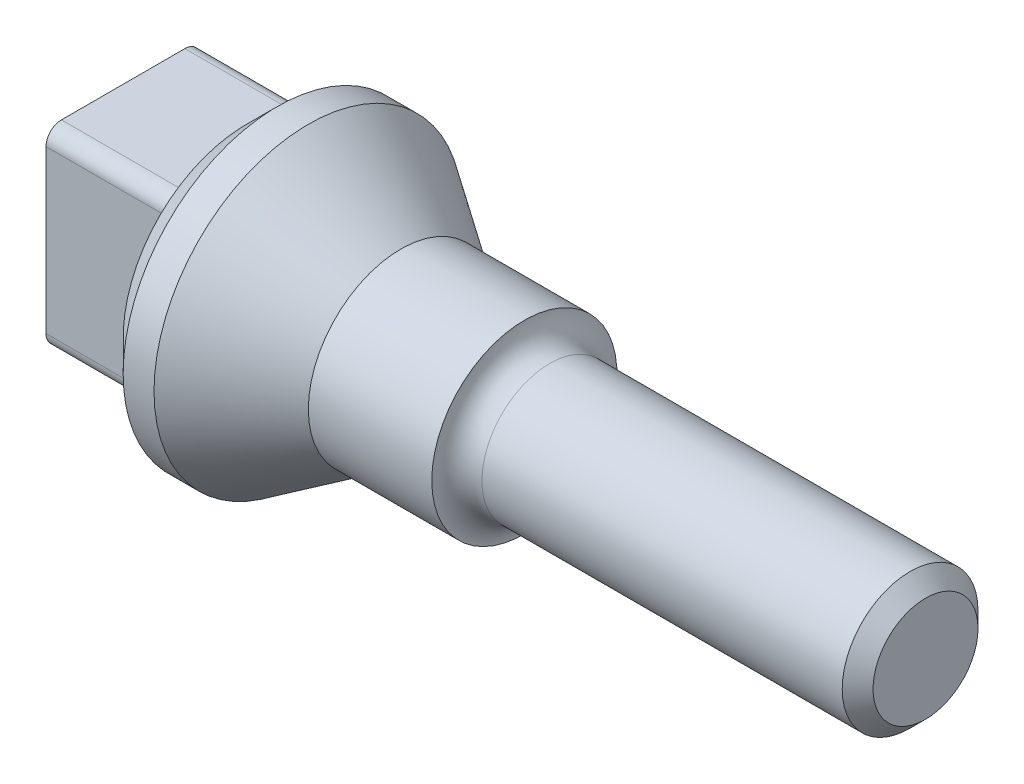
ISO-10303-21;
HEADER;
FILE_DESCRIPTION(('STEP AP214'),'2;1');
FILE_NAME('part.step','',(''),(''),'','','');
FILE_SCHEMA(('AUTOMOTIVE_DESIGN { 1 0 10303 214 1 1 1 1 }'));
ENDSEC;
DATA;
#1=APPLICATION_CONTEXT('core data for automotive mechanical design processes');
#2=APPLICATION_PROTOCOL_DEFINITION('international standard','automotive_design',2000,#1);
#3=PRODUCT_CONTEXT('',#1,'mechanical');
#4=PRODUCT('Part','Part','',(#3));
#5=PRODUCT_RELATED_PRODUCT_CATEGORY('part','',(#4));
#6=PRODUCT_DEFINITION_FORMATION('','',#4);
#7=PRODUCT_DEFINITION_CONTEXT('part definition',#1,'design');
#8=PRODUCT_DEFINITION('design','',#6,#7);
#9=PRODUCT_DEFINITION_SHAPE('','',#8);
#10=(LENGTH_UNIT() NAMED_UNIT(*) SI_UNIT(.MILLI.,.METRE.));
#11=(NAMED_UNIT(*) PLANE_ANGLE_UNIT() SI_UNIT($,.RADIAN.));
#12=(NAMED_UNIT(*) SI_UNIT($,.STERADIAN.) SOLID_ANGLE_UNIT());
#13=UNCERTAINTY_MEASURE_WITH_UNIT(LENGTH_MEASURE(1.E-05),#10,'distance_accuracy_value','');
#14=(GEOMETRIC_REPRESENTATION_CONTEXT(3) GLOBAL_UNCERTAINTY_ASSIGNED_CONTEXT((#13)) GLOBAL_UNIT_ASSIGNED_CONTEXT((#10,
#11,#12)) REPRESENTATION_CONTEXT('',''));
#15=CARTESIAN_POINT('',(0.,0.,0.));
#16=DIRECTION('',(0.,0.,1.));
#17=DIRECTION('',(1.,0.,0.));
#18=AXIS2_PLACEMENT_3D('',#15,#16,#17);
#19=CARTESIAN_POINT('',(0.,0.,0.));
#20=DIRECTION('',(-1.,0.,0.));
#21=DIRECTION('',(0.,0.,1.));
#22=AXIS2_PLACEMENT_3D('',#19,#20,#21);
#23=PLANE('',#22);
#24=CARTESIAN_POINT('',(0.,0.,0.));
#25=DIRECTION('',(-1.,0.,0.));
#26=DIRECTION('',(0.,0.,1.));
#27=AXIS2_PLACEMENT_3D('',#24,#25,#26);
#28=CIRCLE('',#27,40.);
#29=CARTESIAN_POINT('',(0.,-31.224989991992,-25.));
#30=VERTEX_POINT('',#29);
#31=CARTESIAN_POINT('',(0.,-31.224989991992,25.));
#32=VERTEX_POINT('',#31);
#33=EDGE_CURVE('E135',#30,#32,#28,.T.);
#34=ORIENTED_EDGE('',*,*,#33,.T.);
#35=CARTESIAN_POINT('',(0.,31.224989991992,25.));
#36=VERTEX_POINT('',#35);
#37=EDGE_CURVE('E129',#32,#36,#28,.T.);
#38=ORIENTED_EDGE('',*,*,#37,.T.);
#39=CARTESIAN_POINT('',(0.,31.224989991992,-25.));
#40=VERTEX_POINT('',#39);
#41=EDGE_CURVE('E124',#36,#40,#28,.T.);
#42=ORIENTED_EDGE('',*,*,#41,.T.);
#43=EDGE_CURVE('E128',#40,#30,#28,.T.);
#44=ORIENTED_EDGE('',*,*,#43,.T.);
#45=EDGE_LOOP('',(#34,#38,#42,#44));
#46=FACE_BOUND('',#45,.T.);
#47=DIRECTION('',(0.,0.,1.));
#48=VECTOR('',#47,1.);
#49=CARTESIAN_POINT('',(0.,-31.224989991992,-25.));
#50=LINE('',#49,#48);
#51=CARTESIAN_POINT('',(0.,-31.224989991992,-20.));
#52=VERTEX_POINT('',#51);
#53=CARTESIAN_POINT('',(0.,-31.224989991992,20.));
#54=VERTEX_POINT('',#53);
#55=EDGE_CURVE('E60',#52,#54,#50,.T.);
#56=ORIENTED_EDGE('',*,*,#55,.F.);
#57=CARTESIAN_POINT('',(0.,-26.224989991992,-20.));
#58=DIRECTION('',(-1.,0.,0.));
#59=DIRECTION('',(0.,0.,1.));
#60=AXIS2_PLACEMENT_3D('',#57,#58,#59);
#61=CIRCLE('',#60,5.);
#62=CARTESIAN_POINT('',(0.,-26.224989991992,-25.));
#63=VERTEX_POINT('',#62);
#64=EDGE_CURVE('E188',#52,#63,#61,.F.);
#65=ORIENTED_EDGE('',*,*,#64,.T.);
#66=DIRECTION('',(0.,-1.,0.));
#67=VECTOR('',#66,1.);
#68=CARTESIAN_POINT('',(0.,-31.224989991992,-25.));
#69=LINE('',#68,#67);
#70=CARTESIAN_POINT('',(0.,26.224989991992,-25.));
#71=VERTEX_POINT('',#70);
#72=EDGE_CURVE('E68',#71,#63,#69,.T.);
#73=ORIENTED_EDGE('',*,*,#72,.F.);
#74=CARTESIAN_POINT('',(0.,26.224989991992,-20.));
#75=DIRECTION('',(-1.,0.,0.));
#76=DIRECTION('',(0.,0.,1.));
#77=AXIS2_PLACEMENT_3D('',#74,#75,#76);
#78=CIRCLE('',#77,5.);
#79=CARTESIAN_POINT('',(0.,31.224989991992,-20.));
#80=VERTEX_POINT('',#79);
#81=EDGE_CURVE('E184',#71,#80,#78,.F.);
#82=ORIENTED_EDGE('',*,*,#81,.T.);
#83=DIRECTION('',(0.,0.,-1.));
#84=VECTOR('',#83,1.);
#85=CARTESIAN_POINT('',(0.,31.224989991992,-25.));
#86=LINE('',#85,#84);
#87=CARTESIAN_POINT('',(0.,31.224989991992,20.));
#88=VERTEX_POINT('',#87);
#89=EDGE_CURVE('E261',#88,#80,#86,.T.);
#90=ORIENTED_EDGE('',*,*,#89,.F.);
#91=CARTESIAN_POINT('',(0.,26.224989991992,20.));
#92=DIRECTION('',(-1.,0.,0.));
#93=DIRECTION('',(0.,0.,1.));
#94=AXIS2_PLACEMENT_3D('',#91,#92,#93);
#95=CIRCLE('',#94,5.);
#96=CARTESIAN_POINT('',(0.,26.224989991992,25.));
#97=VERTEX_POINT('',#96);
#98=EDGE_CURVE('E152',#88,#97,#95,.F.);
#99=ORIENTED_EDGE('',*,*,#98,.T.);
#100=DIRECTION('',(0.,1.,0.));
#101=VECTOR('',#100,1.);
#102=CARTESIAN_POINT('',(0.,-31.224989991992,25.));
#103=LINE('',#102,#101);
#104=CARTESIAN_POINT('',(0.,-26.224989991992,25.));
#105=VERTEX_POINT('',#104);
#106=EDGE_CURVE('E258',#105,#97,#103,.T.);
#107=ORIENTED_EDGE('',*,*,#106,.F.);
#108=CARTESIAN_POINT('',(0.,-26.224989991992,20.));
#109=DIRECTION('',(-1.,0.,0.));
#110=DIRECTION('',(0.,0.,1.));
#111=AXIS2_PLACEMENT_3D('',#108,#109,#110);
#112=CIRCLE('',#111,5.);
#113=EDGE_CURVE('E191',#105,#54,#112,.F.);
#114=ORIENTED_EDGE('',*,*,#113,.T.);
#115=EDGE_LOOP('',(#56,#65,#73,#82,#90,#99,#107,#114));
#116=FACE_BOUND('',#115,.T.);
#117=ADVANCED_FACE('F43',(#46,#116),#23,.T.);
#118=CARTESIAN_POINT('',(0.,0.,0.));
#119=DIRECTION('',(1.,0.,0.));
#120=DIRECTION('',(0.,0.,-1.));
#121=AXIS2_PLACEMENT_3D('',#118,#119,#120);
#122=CONICAL_SURFACE('',#121,40.,0.785398163397448);
#123=CARTESIAN_POINT('',(10.,0.,0.));
#124=DIRECTION('',(-1.,0.,0.));
#125=DIRECTION('',(0.,0.,1.));
#126=AXIS2_PLACEMENT_3D('',#123,#124,#125);
#127=CIRCLE('',#126,50.);
#128=CARTESIAN_POINT('',(10.,0.,50.));
#129=VERTEX_POINT('',#128);
#130=EDGE_CURVE('E140',#129,#129,#127,.T.);
#131=ORIENTED_EDGE('',*,*,#130,.T.);
#132=EDGE_LOOP('',(#131));
#133=FACE_BOUND('',#132,.T.);
#134=ORIENTED_EDGE('',*,*,#41,.F.);
#135=ORIENTED_EDGE('',*,*,#37,.F.);
#136=ORIENTED_EDGE('',*,*,#33,.F.);
#137=ORIENTED_EDGE('',*,*,#43,.F.);
#138=EDGE_LOOP('',(#134,#135,#136,#137));
#139=FACE_BOUND('',#138,.T.);
#140=ADVANCED_FACE('F134',(#133,#139),#122,.T.);
#141=CARTESIAN_POINT('',(0.,0.,0.));
#142=DIRECTION('',(-1.,0.,0.));
#143=DIRECTION('',(0.,0.,1.));
#144=AXIS2_PLACEMENT_3D('',#141,#142,#143);
#145=CYLINDRICAL_SURFACE('',#144,50.);
#146=CARTESIAN_POINT('',(20.,0.,0.));
#147=DIRECTION('',(-1.,0.,0.));
#148=DIRECTION('',(0.,0.,1.));
#149=AXIS2_PLACEMENT_3D('',#146,#147,#148);
#150=CIRCLE('',#149,50.);
#151=CARTESIAN_POINT('',(20.,0.,50.));
#152=VERTEX_POINT('',#151);
#153=EDGE_CURVE('E275',#152,#152,#150,.T.);
#154=ORIENTED_EDGE('',*,*,#153,.T.);
#155=EDGE_LOOP('',(#154));
#156=FACE_BOUND('',#155,.T.);
#157=ORIENTED_EDGE('',*,*,#130,.F.);
#158=EDGE_LOOP('',(#157));
#159=FACE_BOUND('',#158,.T.);
#160=ADVANCED_FACE('F214',(#156,#159),#145,.T.);
#161=CARTESIAN_POINT('',(20.,0.,0.));
#162=DIRECTION('',(-1.,0.,0.));
#163=DIRECTION('',(0.,0.,1.));
#164=AXIS2_PLACEMENT_3D('',#161,#162,#163);
#165=CONICAL_SURFACE('',#164,50.,0.588002603547568);
#166=CARTESIAN_POINT('',(50.,0.,0.));
#167=DIRECTION('',(-1.,0.,0.));
#168=DIRECTION('',(0.,0.,1.));
#169=AXIS2_PLACEMENT_3D('',#166,#167,#168);
#170=CIRCLE('',#169,30.);
#171=CARTESIAN_POINT('',(50.,0.,30.));
#172=VERTEX_POINT('',#171);
#173=EDGE_CURVE('E272',#172,#172,#170,.T.);
#174=ORIENTED_EDGE('',*,*,#173,.T.);
#175=EDGE_LOOP('',(#174));
#176=FACE_BOUND('',#175,.T.);
#177=ORIENTED_EDGE('',*,*,#153,.F.);
#178=EDGE_LOOP('',(#177));
#179=FACE_BOUND('',#178,.T.);
#180=ADVANCED_FACE('F286',(#176,#179),#165,.T.);
#181=CARTESIAN_POINT('',(0.,0.,0.));
#182=DIRECTION('',(-1.,0.,0.));
#183=DIRECTION('',(0.,0.,1.));
#184=AXIS2_PLACEMENT_3D('',#181,#182,#183);
#185=CYLINDRICAL_SURFACE('',#184,30.);
#186=CARTESIAN_POINT('',(90.,0.,0.));
#187=DIRECTION('',(-1.,0.,0.));
#188=DIRECTION('',(0.,0.,1.));
#189=AXIS2_PLACEMENT_3D('',#186,#187,#188);
#190=CIRCLE('',#189,30.);
#191=CARTESIAN_POINT('',(90.,0.,30.));
#192=VERTEX_POINT('',#191);
#193=EDGE_CURVE('E252',#192,#192,#190,.T.);
#194=ORIENTED_EDGE('',*,*,#193,.T.);
#195=EDGE_LOOP('',(#194));
#196=FACE_BOUND('',#195,.T.);
#197=ORIENTED_EDGE('',*,*,#173,.F.);
#198=EDGE_LOOP('',(#197));
#199=FACE_BOUND('',#198,.T.);
#200=ADVANCED_FACE('F290',(#196,#199),#185,.T.);
#201=CARTESIAN_POINT('',(98.2329651863445,0.,0.));
#202=DIRECTION('',(-1.,0.,0.));
#203=DIRECTION('',(0.,0.,1.));
#204=AXIS2_PLACEMENT_3D('',#201,#202,#203);
#205=TOROIDAL_SURFACE('',#204,30.2363572349726,8.23635723497257);
#206=ORIENTED_EDGE('',*,*,#193,.F.);
#207=EDGE_LOOP('',(#206));
#208=FACE_BOUND('',#207,.T.);
#209=CARTESIAN_POINT('',(98.2329651863445,0.,0.));
#210=DIRECTION('',(-1.,0.,0.));
#211=DIRECTION('',(0.,0.,1.));
#212=AXIS2_PLACEMENT_3D('',#209,#210,#211);
#213=CIRCLE('',#212,22.);
#214=CARTESIAN_POINT('',(98.2329651863445,0.,22.));
#215=VERTEX_POINT('',#214);
#216=EDGE_CURVE('E247',#215,#215,#213,.T.);
#217=ORIENTED_EDGE('',*,*,#216,.T.);
#218=EDGE_LOOP('',(#217));
#219=FACE_BOUND('',#218,.T.);
#220=ADVANCED_FACE('F296',(#208,#219),#205,.F.);
#221=CARTESIAN_POINT('',(0.,0.,0.));
#222=DIRECTION('',(-1.,0.,0.));
#223=DIRECTION('',(0.,0.,1.));
#224=AXIS2_PLACEMENT_3D('',#221,#222,#223);
#225=CYLINDRICAL_SURFACE('',#224,22.);
#226=CARTESIAN_POINT('',(215.,0.,0.));
#227=DIRECTION('',(1.,0.,0.));
#228=DIRECTION('',(0.,0.,-1.));
#229=AXIS2_PLACEMENT_3D('',#226,#227,#228);
#230=CIRCLE('',#229,22.);
#231=CARTESIAN_POINT('',(215.,0.,-22.));
#232=VERTEX_POINT('',#231);
#233=EDGE_CURVE('E53',#232,#232,#230,.F.);
#234=ORIENTED_EDGE('',*,*,#233,.T.);
#235=EDGE_LOOP('',(#234));
#236=FACE_BOUND('',#235,.T.);
#237=ORIENTED_EDGE('',*,*,#216,.F.);
#238=EDGE_LOOP('',(#237));
#239=FACE_BOUND('',#238,.T.);
#240=ADVANCED_FACE('F197',(#236,#239),#225,.T.);
#241=CARTESIAN_POINT('',(220.,0.,0.));
#242=DIRECTION('',(1.,0.,0.));
#243=DIRECTION('',(0.,0.,-1.));
#244=AXIS2_PLACEMENT_3D('',#241,#242,#243);
#245=PLANE('',#244);
#246=CARTESIAN_POINT('',(220.,0.,0.));
#247=DIRECTION('',(1.,0.,0.));
#248=DIRECTION('',(0.,0.,-1.));
#249=AXIS2_PLACEMENT_3D('',#246,#247,#248);
#250=CIRCLE('',#249,17.);
#251=CARTESIAN_POINT('',(220.,0.,-17.));
#252=VERTEX_POINT('',#251);
#253=EDGE_CURVE('E11',#252,#252,#250,.T.);
#254=ORIENTED_EDGE('',*,*,#253,.T.);
#255=EDGE_LOOP('',(#254));
#256=FACE_BOUND('',#255,.T.);
#257=ADVANCED_FACE('F303',(#256),#245,.T.);
#258=CARTESIAN_POINT('',(-40.,-31.224989991992,25.));
#259=DIRECTION('',(0.,0.,-1.));
#260=DIRECTION('',(-1.,0.,0.));
#261=AXIS2_PLACEMENT_3D('',#258,#259,#260);
#262=PLANE('',#261);
#263=DIRECTION('',(0.,1.,0.));
#264=VECTOR('',#263,1.);
#265=CARTESIAN_POINT('',(-40.,-31.224989991992,25.));
#266=LINE('',#265,#264);
#267=CARTESIAN_POINT('',(-40.,-26.224989991992,25.));
#268=VERTEX_POINT('',#267);
#269=CARTESIAN_POINT('',(-40.,26.224989991992,25.));
#270=VERTEX_POINT('',#269);
#271=EDGE_CURVE('E267',#268,#270,#266,.T.);
#272=ORIENTED_EDGE('',*,*,#271,.F.);
#273=DIRECTION('',(1.,0.,0.));
#274=VECTOR('',#273,1.);
#275=CARTESIAN_POINT('',(-40.,-26.224989991992,25.));
#276=LINE('',#275,#274);
#277=EDGE_CURVE('E180',#268,#105,#276,.T.);
#278=ORIENTED_EDGE('',*,*,#277,.T.);
#279=ORIENTED_EDGE('',*,*,#106,.T.);
#280=DIRECTION('',(1.,0.,0.));
#281=VECTOR('',#280,1.);
#282=CARTESIAN_POINT('',(-40.,26.224989991992,25.));
#283=LINE('',#282,#281);
#284=EDGE_CURVE('E145',#97,#270,#283,.F.);
#285=ORIENTED_EDGE('',*,*,#284,.T.);
#286=EDGE_LOOP('',(#272,#278,#279,#285));
#287=FACE_BOUND('',#286,.T.);
#288=ADVANCED_FACE('F306',(#287),#262,.F.);
#289=CARTESIAN_POINT('',(-40.,31.224989991992,-25.));
#290=DIRECTION('',(0.,-1.,0.));
#291=DIRECTION('',(0.,0.,-1.));
#292=AXIS2_PLACEMENT_3D('',#289,#290,#291);
#293=PLANE('',#292);
#294=ORIENTED_EDGE('',*,*,#89,.T.);
#295=DIRECTION('',(1.,0.,0.));
#296=VECTOR('',#295,1.);
#297=CARTESIAN_POINT('',(-40.,31.224989991992,-20.));
#298=LINE('',#297,#296);
#299=CARTESIAN_POINT('',(-40.,31.224989991992,-20.));
#300=VERTEX_POINT('',#299);
#301=EDGE_CURVE('E162',#80,#300,#298,.F.);
#302=ORIENTED_EDGE('',*,*,#301,.T.);
#303=DIRECTION('',(0.,0.,-1.));
#304=VECTOR('',#303,1.);
#305=CARTESIAN_POINT('',(-40.,31.224989991992,-25.));
#306=LINE('',#305,#304);
#307=CARTESIAN_POINT('',(-40.,31.224989991992,20.));
#308=VERTEX_POINT('',#307);
#309=EDGE_CURVE('E254',#308,#300,#306,.T.);
#310=ORIENTED_EDGE('',*,*,#309,.F.);
#311=DIRECTION('',(1.,0.,0.));
#312=VECTOR('',#311,1.);
#313=CARTESIAN_POINT('',(-40.,31.224989991992,20.));
#314=LINE('',#313,#312);
#315=EDGE_CURVE('E132',#308,#88,#314,.T.);
#316=ORIENTED_EDGE('',*,*,#315,.T.);
#317=EDGE_LOOP('',(#294,#302,#310,#316));
#318=FACE_BOUND('',#317,.T.);
#319=ADVANCED_FACE('F310',(#318),#293,.F.);
#320=CARTESIAN_POINT('',(-40.,-31.224989991992,-25.));
#321=DIRECTION('',(0.,0.,1.));
#322=DIRECTION('',(1.,0.,0.));
#323=AXIS2_PLACEMENT_3D('',#320,#321,#322);
#324=PLANE('',#323);
#325=DIRECTION('',(0.,-1.,0.));
#326=VECTOR('',#325,1.);
#327=CARTESIAN_POINT('',(-40.,-31.224989991992,-25.));
#328=LINE('',#327,#326);
#329=CARTESIAN_POINT('',(-40.,26.224989991992,-25.));
#330=VERTEX_POINT('',#329);
#331=CARTESIAN_POINT('',(-40.,-26.224989991992,-25.));
#332=VERTEX_POINT('',#331);
#333=EDGE_CURVE('E243',#330,#332,#328,.T.);
#334=ORIENTED_EDGE('',*,*,#333,.F.);
#335=DIRECTION('',(1.,0.,0.));
#336=VECTOR('',#335,1.);
#337=CARTESIAN_POINT('',(-40.,26.224989991992,-25.));
#338=LINE('',#337,#336);
#339=EDGE_CURVE('E159',#330,#71,#338,.T.);
#340=ORIENTED_EDGE('',*,*,#339,.T.);
#341=ORIENTED_EDGE('',*,*,#72,.T.);
#342=DIRECTION('',(1.,0.,0.));
#343=VECTOR('',#342,1.);
#344=CARTESIAN_POINT('',(-40.,-26.224989991992,-25.));
#345=LINE('',#344,#343);
#346=EDGE_CURVE('E156',#63,#332,#345,.F.);
#347=ORIENTED_EDGE('',*,*,#346,.T.);
#348=EDGE_LOOP('',(#334,#340,#341,#347));
#349=FACE_BOUND('',#348,.T.);
#350=ADVANCED_FACE('F314',(#349),#324,.F.);
#351=CARTESIAN_POINT('',(-40.,-31.224989991992,-25.));
#352=DIRECTION('',(0.,1.,0.));
#353=DIRECTION('',(0.,0.,1.));
#354=AXIS2_PLACEMENT_3D('',#351,#352,#353);
#355=PLANE('',#354);
#356=DIRECTION('',(0.,0.,1.));
#357=VECTOR('',#356,1.);
#358=CARTESIAN_POINT('',(-40.,-31.224989991992,-25.));
#359=LINE('',#358,#357);
#360=CARTESIAN_POINT('',(-40.,-31.224989991992,-20.));
#361=VERTEX_POINT('',#360);
#362=CARTESIAN_POINT('',(-40.,-31.224989991992,20.));
#363=VERTEX_POINT('',#362);
#364=EDGE_CURVE('E240',#361,#363,#359,.T.);
#365=ORIENTED_EDGE('',*,*,#364,.F.);
#366=DIRECTION('',(1.,0.,0.));
#367=VECTOR('',#366,1.);
#368=CARTESIAN_POINT('',(-40.,-31.224989991992,-20.));
#369=LINE('',#368,#367);
#370=EDGE_CURVE('E177',#361,#52,#369,.T.);
#371=ORIENTED_EDGE('',*,*,#370,.T.);
#372=ORIENTED_EDGE('',*,*,#55,.T.);
#373=DIRECTION('',(1.,0.,0.));
#374=VECTOR('',#373,1.);
#375=CARTESIAN_POINT('',(-40.,-31.224989991992,20.));
#376=LINE('',#375,#374);
#377=EDGE_CURVE('E174',#54,#363,#376,.F.);
#378=ORIENTED_EDGE('',*,*,#377,.T.);
#379=EDGE_LOOP('',(#365,#371,#372,#378));
#380=FACE_BOUND('',#379,.T.);
#381=ADVANCED_FACE('F244',(#380),#355,.F.);
#382=CARTESIAN_POINT('',(-40.,0.,0.));
#383=DIRECTION('',(1.,0.,0.));
#384=DIRECTION('',(0.,0.,-1.));
#385=AXIS2_PLACEMENT_3D('',#382,#383,#384);
#386=PLANE('',#385);
#387=ORIENTED_EDGE('',*,*,#309,.T.);
#388=CARTESIAN_POINT('',(-40.,26.224989991992,-20.));
#389=DIRECTION('',(1.,0.,0.));
#390=DIRECTION('',(0.,0.,-1.));
#391=AXIS2_PLACEMENT_3D('',#388,#389,#390);
#392=CIRCLE('',#391,5.);
#393=EDGE_CURVE('E171',#300,#330,#392,.F.);
#394=ORIENTED_EDGE('',*,*,#393,.T.);
#395=ORIENTED_EDGE('',*,*,#333,.T.);
#396=CARTESIAN_POINT('',(-40.,-26.224989991992,-20.));
#397=DIRECTION('',(1.,0.,0.));
#398=DIRECTION('',(0.,0.,-1.));
#399=AXIS2_PLACEMENT_3D('',#396,#397,#398);
#400=CIRCLE('',#399,5.);
#401=EDGE_CURVE('E168',#332,#361,#400,.F.);
#402=ORIENTED_EDGE('',*,*,#401,.T.);
#403=ORIENTED_EDGE('',*,*,#364,.T.);
#404=CARTESIAN_POINT('',(-40.,-26.224989991992,20.));
#405=DIRECTION('',(1.,0.,0.));
#406=DIRECTION('',(0.,0.,-1.));
#407=AXIS2_PLACEMENT_3D('',#404,#405,#406);
#408=CIRCLE('',#407,5.);
#409=EDGE_CURVE('E165',#363,#268,#408,.F.);
#410=ORIENTED_EDGE('',*,*,#409,.T.);
#411=ORIENTED_EDGE('',*,*,#271,.T.);
#412=CARTESIAN_POINT('',(-40.,26.224989991992,20.));
#413=DIRECTION('',(1.,0.,0.));
#414=DIRECTION('',(0.,0.,-1.));
#415=AXIS2_PLACEMENT_3D('',#412,#413,#414);
#416=CIRCLE('',#415,5.);
#417=EDGE_CURVE('E149',#270,#308,#416,.F.);
#418=ORIENTED_EDGE('',*,*,#417,.T.);
#419=EDGE_LOOP('',(#387,#394,#395,#402,#403,#410,#411,#418));
#420=FACE_BOUND('',#419,.T.);
#421=ADVANCED_FACE('F223',(#420),#386,.F.);
#422=CARTESIAN_POINT('',(-40.,26.224989991992,20.));
#423=DIRECTION('',(1.,0.,0.));
#424=DIRECTION('',(0.,0.,-1.));
#425=AXIS2_PLACEMENT_3D('',#422,#423,#424);
#426=CYLINDRICAL_SURFACE('',#425,5.);
#427=ORIENTED_EDGE('',*,*,#417,.F.);
#428=ORIENTED_EDGE('',*,*,#284,.F.);
#429=ORIENTED_EDGE('',*,*,#98,.F.);
#430=ORIENTED_EDGE('',*,*,#315,.F.);
#431=EDGE_LOOP('',(#427,#428,#429,#430));
#432=FACE_BOUND('',#431,.T.);
#433=ADVANCED_FACE('F219',(#432),#426,.T.);
#434=CARTESIAN_POINT('',(-40.,26.224989991992,-20.));
#435=DIRECTION('',(1.,0.,0.));
#436=DIRECTION('',(0.,0.,-1.));
#437=AXIS2_PLACEMENT_3D('',#434,#435,#436);
#438=CYLINDRICAL_SURFACE('',#437,5.);
#439=ORIENTED_EDGE('',*,*,#393,.F.);
#440=ORIENTED_EDGE('',*,*,#301,.F.);
#441=ORIENTED_EDGE('',*,*,#81,.F.);
#442=ORIENTED_EDGE('',*,*,#339,.F.);
#443=EDGE_LOOP('',(#439,#440,#441,#442));
#444=FACE_BOUND('',#443,.T.);
#445=ADVANCED_FACE('F222',(#444),#438,.T.);
#446=CARTESIAN_POINT('',(-40.,-26.224989991992,-20.));
#447=DIRECTION('',(1.,0.,0.));
#448=DIRECTION('',(0.,0.,-1.));
#449=AXIS2_PLACEMENT_3D('',#446,#447,#448);
#450=CYLINDRICAL_SURFACE('',#449,5.);
#451=ORIENTED_EDGE('',*,*,#401,.F.);
#452=ORIENTED_EDGE('',*,*,#346,.F.);
#453=ORIENTED_EDGE('',*,*,#64,.F.);
#454=ORIENTED_EDGE('',*,*,#370,.F.);
#455=EDGE_LOOP('',(#451,#452,#453,#454));
#456=FACE_BOUND('',#455,.T.);
#457=ADVANCED_FACE('F206',(#456),#450,.T.);
#458=CARTESIAN_POINT('',(-40.,-26.224989991992,20.));
#459=DIRECTION('',(1.,0.,0.));
#460=DIRECTION('',(0.,0.,-1.));
#461=AXIS2_PLACEMENT_3D('',#458,#459,#460);
#462=CYLINDRICAL_SURFACE('',#461,5.);
#463=ORIENTED_EDGE('',*,*,#409,.F.);
#464=ORIENTED_EDGE('',*,*,#377,.F.);
#465=ORIENTED_EDGE('',*,*,#113,.F.);
#466=ORIENTED_EDGE('',*,*,#277,.F.);
#467=EDGE_LOOP('',(#463,#464,#465,#466));
#468=FACE_BOUND('',#467,.T.);
#469=ADVANCED_FACE('F201',(#468),#462,.T.);
#470=CARTESIAN_POINT('',(215.,0.,0.));
#471=DIRECTION('',(-1.,0.,0.));
#472=DIRECTION('',(0.,0.,1.));
#473=AXIS2_PLACEMENT_3D('',#470,#471,#472);
#474=CONICAL_SURFACE('',#473,22.,0.785398163397452);
#475=ORIENTED_EDGE('',*,*,#253,.F.);
#476=EDGE_LOOP('',(#475));
#477=FACE_BOUND('',#476,.T.);
#478=ORIENTED_EDGE('',*,*,#233,.F.);
#479=EDGE_LOOP('',(#478));
#480=FACE_BOUND('',#479,.T.);
#481=ADVANCED_FACE('F46',(#477,#480),#474,.T.);
#482=CLOSED_SHELL('',(#117,#140,#160,#180,#200,#220,#240,#257,#288,#319,#350,#381,#421,#433,
#445,#457,#469,#481));
#483=MANIFOLD_SOLID_BREP('B2',#482);
#484=ADVANCED_BREP_SHAPE_REPRESENTATION('',(#18,#483),#14);
#485=SHAPE_DEFINITION_REPRESENTATION(#9,#484);
ENDSEC;
END-ISO-10303-21;
